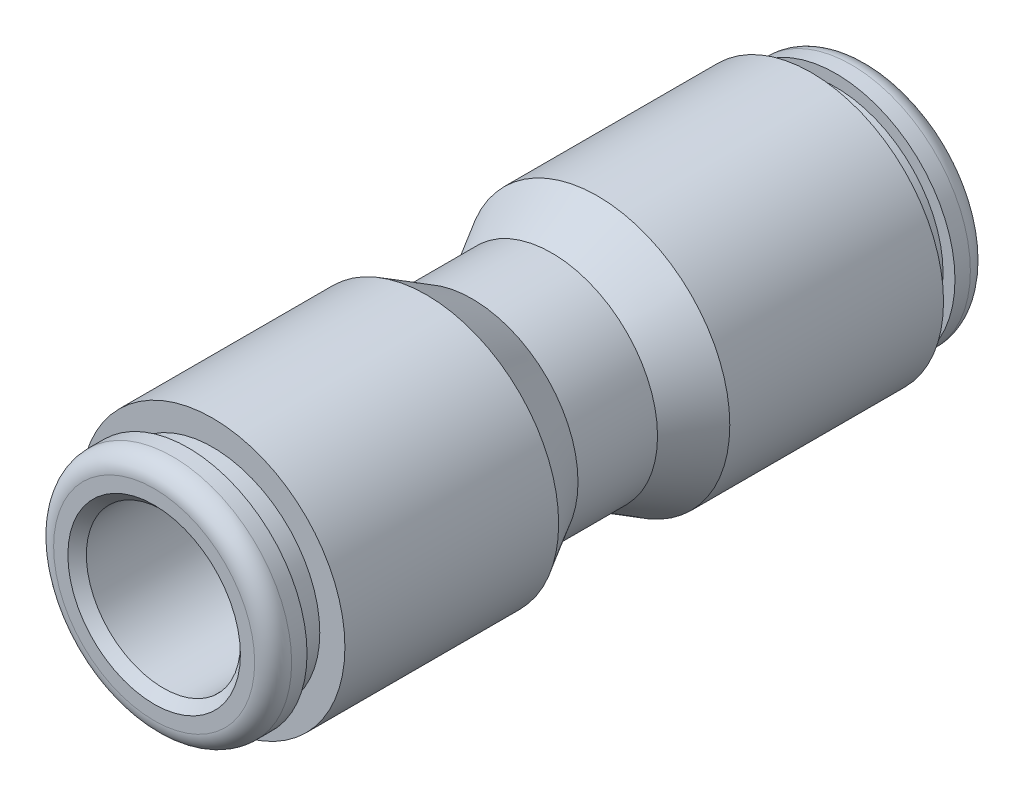
ISO-10303-21;
HEADER;
FILE_DESCRIPTION(('STEP AP214'),'2;1');
FILE_NAME('part.step','',(''),(''),'','','');
FILE_SCHEMA(('AUTOMOTIVE_DESIGN { 1 0 10303 214 1 1 1 1 }'));
ENDSEC;
DATA;
#1=APPLICATION_CONTEXT('core data for automotive mechanical design processes');
#2=APPLICATION_PROTOCOL_DEFINITION('international standard','automotive_design',2000,#1);
#3=PRODUCT_CONTEXT('',#1,'mechanical');
#4=PRODUCT('Part','Part','',(#3));
#5=PRODUCT_RELATED_PRODUCT_CATEGORY('part','',(#4));
#6=PRODUCT_DEFINITION_FORMATION('','',#4);
#7=PRODUCT_DEFINITION_CONTEXT('part definition',#1,'design');
#8=PRODUCT_DEFINITION('design','',#6,#7);
#9=PRODUCT_DEFINITION_SHAPE('','',#8);
#10=(LENGTH_UNIT() NAMED_UNIT(*) SI_UNIT(.MILLI.,.METRE.));
#11=(NAMED_UNIT(*) PLANE_ANGLE_UNIT() SI_UNIT($,.RADIAN.));
#12=(NAMED_UNIT(*) SI_UNIT($,.STERADIAN.) SOLID_ANGLE_UNIT());
#13=UNCERTAINTY_MEASURE_WITH_UNIT(LENGTH_MEASURE(1.E-05),#10,'distance_accuracy_value','');
#14=(GEOMETRIC_REPRESENTATION_CONTEXT(3) GLOBAL_UNCERTAINTY_ASSIGNED_CONTEXT((#13)) GLOBAL_UNIT_ASSIGNED_CONTEXT((#10,
#11,#12)) REPRESENTATION_CONTEXT('',''));
#15=CARTESIAN_POINT('',(0.,0.,0.));
#16=DIRECTION('',(0.,0.,1.));
#17=DIRECTION('',(1.,0.,0.));
#18=AXIS2_PLACEMENT_3D('',#15,#16,#17);
#19=CARTESIAN_POINT('',(0.,0.,-3.52682426913896));
#20=DIRECTION('',(0.,0.,-1.));
#21=DIRECTION('',(-1.,0.,0.));
#22=AXIS2_PLACEMENT_3D('',#19,#20,#21);
#23=CONICAL_SURFACE('',#22,5.45,0.523598775598301);
#24=CARTESIAN_POINT('',(0.,0.,-1.63888888888889));
#25=DIRECTION('',(0.,0.,1.));
#26=DIRECTION('',(1.,0.,0.));
#27=AXIS2_PLACEMENT_3D('',#24,#25,#26);
#28=CIRCLE('',#27,4.36);
#29=CARTESIAN_POINT('',(4.36,0.,-1.63888888888889));
#30=VERTEX_POINT('',#29);
#31=EDGE_CURVE('E74',#30,#30,#28,.T.);
#32=ORIENTED_EDGE('',*,*,#31,.F.);
#33=EDGE_LOOP('',(#32));
#34=FACE_BOUND('',#33,.T.);
#35=CARTESIAN_POINT('',(0.,0.,-3.52682426913896));
#36=DIRECTION('',(0.,0.,1.));
#37=DIRECTION('',(1.,0.,0.));
#38=AXIS2_PLACEMENT_3D('',#35,#36,#37);
#39=CIRCLE('',#38,5.45);
#40=CARTESIAN_POINT('',(5.45,0.,-3.52682426913896));
#41=VERTEX_POINT('',#40);
#42=EDGE_CURVE('E10',#41,#41,#39,.T.);
#43=ORIENTED_EDGE('',*,*,#42,.T.);
#44=EDGE_LOOP('',(#43));
#45=FACE_BOUND('',#44,.T.);
#46=ADVANCED_FACE('F34',(#34,#45),#23,.T.);
#47=CARTESIAN_POINT('',(0.,0.,0.));
#48=DIRECTION('',(0.,0.,1.));
#49=DIRECTION('',(1.,0.,0.));
#50=AXIS2_PLACEMENT_3D('',#47,#48,#49);
#51=CYLINDRICAL_SURFACE('',#50,5.45);
#52=ORIENTED_EDGE('',*,*,#42,.F.);
#53=EDGE_LOOP('',(#52));
#54=FACE_BOUND('',#53,.T.);
#55=CARTESIAN_POINT('',(0.,0.,-12.337));
#56=DIRECTION('',(0.,0.,1.));
#57=DIRECTION('',(1.,0.,0.));
#58=AXIS2_PLACEMENT_3D('',#55,#56,#57);
#59=CIRCLE('',#58,5.45);
#60=CARTESIAN_POINT('',(5.45,0.,-12.337));
#61=VERTEX_POINT('',#60);
#62=EDGE_CURVE('E40',#61,#61,#59,.T.);
#63=ORIENTED_EDGE('',*,*,#62,.T.);
#64=EDGE_LOOP('',(#63));
#65=FACE_BOUND('',#64,.T.);
#66=ADVANCED_FACE('F132',(#54,#65),#51,.T.);
#67=CARTESIAN_POINT('',(0.,5.45,-12.337));
#68=DIRECTION('',(0.,0.,1.));
#69=DIRECTION('',(1.,0.,0.));
#70=AXIS2_PLACEMENT_3D('',#67,#68,#69);
#71=PLANE('',#70);
#72=ORIENTED_EDGE('',*,*,#62,.F.);
#73=EDGE_LOOP('',(#72));
#74=FACE_BOUND('',#73,.T.);
#75=CARTESIAN_POINT('',(0.,0.,-12.337));
#76=DIRECTION('',(0.,0.,1.));
#77=DIRECTION('',(1.,0.,0.));
#78=AXIS2_PLACEMENT_3D('',#75,#76,#77);
#79=CIRCLE('',#78,4.4145);
#80=CARTESIAN_POINT('',(4.4145,0.,-12.337));
#81=VERTEX_POINT('',#80);
#82=EDGE_CURVE('E44',#81,#81,#79,.T.);
#83=ORIENTED_EDGE('',*,*,#82,.T.);
#84=EDGE_LOOP('',(#83));
#85=FACE_BOUND('',#84,.T.);
#86=ADVANCED_FACE('F137',(#74,#85),#71,.F.);
#87=CARTESIAN_POINT('',(0.,0.,0.));
#88=DIRECTION('',(0.,0.,1.));
#89=DIRECTION('',(1.,0.,0.));
#90=AXIS2_PLACEMENT_3D('',#87,#88,#89);
#91=CYLINDRICAL_SURFACE('',#90,4.4145);
#92=ORIENTED_EDGE('',*,*,#82,.F.);
#93=EDGE_LOOP('',(#92));
#94=FACE_BOUND('',#93,.T.);
#95=CARTESIAN_POINT('',(0.,0.,-13.353));
#96=DIRECTION('',(0.,0.,1.));
#97=DIRECTION('',(1.,0.,0.));
#98=AXIS2_PLACEMENT_3D('',#95,#96,#97);
#99=CIRCLE('',#98,4.4145);
#100=CARTESIAN_POINT('',(4.4145,0.,-13.353));
#101=VERTEX_POINT('',#100);
#102=EDGE_CURVE('E48',#101,#101,#99,.T.);
#103=ORIENTED_EDGE('',*,*,#102,.T.);
#104=EDGE_LOOP('',(#103));
#105=FACE_BOUND('',#104,.T.);
#106=ADVANCED_FACE('F143',(#94,#105),#91,.T.);
#107=CARTESIAN_POINT('',(0.,4.905,-13.353));
#108=DIRECTION('',(0.,0.,-1.));
#109=DIRECTION('',(-1.,0.,0.));
#110=AXIS2_PLACEMENT_3D('',#107,#108,#109);
#111=PLANE('',#110);
#112=ORIENTED_EDGE('',*,*,#102,.F.);
#113=EDGE_LOOP('',(#112));
#114=FACE_BOUND('',#113,.T.);
#115=CARTESIAN_POINT('',(0.,0.,-13.353));
#116=DIRECTION('',(0.,0.,1.));
#117=DIRECTION('',(1.,0.,0.));
#118=AXIS2_PLACEMENT_3D('',#115,#116,#117);
#119=CIRCLE('',#118,4.905);
#120=CARTESIAN_POINT('',(4.905,0.,-13.353));
#121=VERTEX_POINT('',#120);
#122=EDGE_CURVE('E53',#121,#121,#119,.T.);
#123=ORIENTED_EDGE('',*,*,#122,.T.);
#124=EDGE_LOOP('',(#123));
#125=FACE_BOUND('',#124,.T.);
#126=ADVANCED_FACE('F149',(#114,#125),#111,.F.);
#127=CARTESIAN_POINT('',(0.,0.,0.));
#128=DIRECTION('',(0.,0.,1.));
#129=DIRECTION('',(1.,0.,0.));
#130=AXIS2_PLACEMENT_3D('',#127,#128,#129);
#131=CYLINDRICAL_SURFACE('',#130,4.905);
#132=ORIENTED_EDGE('',*,*,#122,.F.);
#133=EDGE_LOOP('',(#132));
#134=FACE_BOUND('',#133,.T.);
#135=CARTESIAN_POINT('',(0.,0.,-13.988));
#136=DIRECTION('',(0.,0.,1.));
#137=DIRECTION('',(1.,0.,0.));
#138=AXIS2_PLACEMENT_3D('',#135,#136,#137);
#139=CIRCLE('',#138,4.905);
#140=CARTESIAN_POINT('',(4.905,0.,-13.988));
#141=VERTEX_POINT('',#140);
#142=EDGE_CURVE('E56',#141,#141,#139,.T.);
#143=ORIENTED_EDGE('',*,*,#142,.T.);
#144=EDGE_LOOP('',(#143));
#145=FACE_BOUND('',#144,.T.);
#146=ADVANCED_FACE('F153',(#134,#145),#131,.T.);
#147=CARTESIAN_POINT('',(0.,0.,-13.988));
#148=DIRECTION('',(0.,0.,1.));
#149=DIRECTION('',(1.,0.,0.));
#150=AXIS2_PLACEMENT_3D('',#147,#148,#149);
#151=TOROIDAL_SURFACE('',#150,4.143,0.761999999999999);
#152=ORIENTED_EDGE('',*,*,#142,.F.);
#153=EDGE_LOOP('',(#152));
#154=FACE_BOUND('',#153,.T.);
#155=CARTESIAN_POINT('',(0.,0.,-14.75));
#156=DIRECTION('',(0.,0.,1.));
#157=DIRECTION('',(1.,0.,0.));
#158=AXIS2_PLACEMENT_3D('',#155,#156,#157);
#159=CIRCLE('',#158,4.143);
#160=CARTESIAN_POINT('',(4.143,0.,-14.75));
#161=VERTEX_POINT('',#160);
#162=EDGE_CURVE('E59',#161,#161,#159,.T.);
#163=ORIENTED_EDGE('',*,*,#162,.T.);
#164=EDGE_LOOP('',(#163));
#165=FACE_BOUND('',#164,.T.);
#166=ADVANCED_FACE('F157',(#154,#165),#151,.T.);
#167=CARTESIAN_POINT('',(0.,4.143,-14.75));
#168=DIRECTION('',(0.,0.,1.));
#169=DIRECTION('',(1.,0.,0.));
#170=AXIS2_PLACEMENT_3D('',#167,#168,#169);
#171=PLANE('',#170);
#172=ORIENTED_EDGE('',*,*,#162,.F.);
#173=EDGE_LOOP('',(#172));
#174=FACE_BOUND('',#173,.T.);
#175=CARTESIAN_POINT('',(0.,0.,-14.75));
#176=DIRECTION('',(0.,0.,1.));
#177=DIRECTION('',(1.,0.,0.));
#178=AXIS2_PLACEMENT_3D('',#175,#176,#177);
#179=CIRCLE('',#178,3.556);
#180=CARTESIAN_POINT('',(3.556,0.,-14.75));
#181=VERTEX_POINT('',#180);
#182=EDGE_CURVE('E62',#181,#181,#179,.T.);
#183=ORIENTED_EDGE('',*,*,#182,.T.);
#184=EDGE_LOOP('',(#183));
#185=FACE_BOUND('',#184,.T.);
#186=ADVANCED_FACE('F161',(#174,#185),#171,.F.);
#187=CARTESIAN_POINT('',(0.,0.,-14.369));
#188=DIRECTION('',(0.,0.,-1.));
#189=DIRECTION('',(-1.,0.,0.));
#190=AXIS2_PLACEMENT_3D('',#187,#188,#189);
#191=CONICAL_SURFACE('',#190,3.175,0.785398163397449);
#192=ORIENTED_EDGE('',*,*,#182,.F.);
#193=EDGE_LOOP('',(#192));
#194=FACE_BOUND('',#193,.T.);
#195=CARTESIAN_POINT('',(0.,0.,-14.369));
#196=DIRECTION('',(0.,0.,1.));
#197=DIRECTION('',(1.,0.,0.));
#198=AXIS2_PLACEMENT_3D('',#195,#196,#197);
#199=CIRCLE('',#198,3.175);
#200=CARTESIAN_POINT('',(3.175,0.,-14.369));
#201=VERTEX_POINT('',#200);
#202=EDGE_CURVE('E65',#201,#201,#199,.T.);
#203=ORIENTED_EDGE('',*,*,#202,.T.);
#204=EDGE_LOOP('',(#203));
#205=FACE_BOUND('',#204,.T.);
#206=ADVANCED_FACE('F165',(#194,#205),#191,.F.);
#207=CARTESIAN_POINT('',(0.,0.,0.));
#208=DIRECTION('',(0.,0.,1.));
#209=DIRECTION('',(1.,0.,0.));
#210=AXIS2_PLACEMENT_3D('',#207,#208,#209);
#211=CYLINDRICAL_SURFACE('',#210,3.175);
#212=ORIENTED_EDGE('',*,*,#202,.F.);
#213=EDGE_LOOP('',(#212));
#214=FACE_BOUND('',#213,.T.);
#215=CARTESIAN_POINT('',(0.,0.,-0.250000000000002));
#216=DIRECTION('',(0.,0.,1.));
#217=DIRECTION('',(1.,0.,0.));
#218=AXIS2_PLACEMENT_3D('',#215,#216,#217);
#219=CIRCLE('',#218,3.175);
#220=CARTESIAN_POINT('',(3.175,0.,-0.250000000000002));
#221=VERTEX_POINT('',#220);
#222=EDGE_CURVE('E68',#221,#221,#219,.T.);
#223=ORIENTED_EDGE('',*,*,#222,.T.);
#224=EDGE_LOOP('',(#223));
#225=FACE_BOUND('',#224,.T.);
#226=ADVANCED_FACE('F169',(#214,#225),#211,.F.);
#227=CARTESIAN_POINT('',(0.,3.175,-0.250000000000002));
#228=DIRECTION('',(0.,0.,1.));
#229=DIRECTION('',(1.,0.,0.));
#230=AXIS2_PLACEMENT_3D('',#227,#228,#229);
#231=PLANE('',#230);
#232=ORIENTED_EDGE('',*,*,#222,.F.);
#233=EDGE_LOOP('',(#232));
#234=FACE_BOUND('',#233,.T.);
#235=CARTESIAN_POINT('',(0.,0.,-0.250000000000002));
#236=DIRECTION('',(0.,0.,1.));
#237=DIRECTION('',(1.,0.,0.));
#238=AXIS2_PLACEMENT_3D('',#235,#236,#237);
#239=CIRCLE('',#238,2.413);
#240=CARTESIAN_POINT('',(2.413,0.,-0.250000000000002));
#241=VERTEX_POINT('',#240);
#242=EDGE_CURVE('E71',#241,#241,#239,.T.);
#243=ORIENTED_EDGE('',*,*,#242,.T.);
#244=EDGE_LOOP('',(#243));
#245=FACE_BOUND('',#244,.T.);
#246=ADVANCED_FACE('F128',(#234,#245),#231,.F.);
#247=CARTESIAN_POINT('',(0.,0.,0.));
#248=DIRECTION('',(0.,0.,1.));
#249=DIRECTION('',(1.,0.,0.));
#250=AXIS2_PLACEMENT_3D('',#247,#248,#249);
#251=CYLINDRICAL_SURFACE('',#250,2.413);
#252=ORIENTED_EDGE('',*,*,#242,.F.);
#253=EDGE_LOOP('',(#252));
#254=FACE_BOUND('',#253,.T.);
#255=CARTESIAN_POINT('',(0.,0.,0.250000000000002));
#256=DIRECTION('',(0.,0.,1.));
#257=DIRECTION('',(1.,0.,0.));
#258=AXIS2_PLACEMENT_3D('',#255,#256,#257);
#259=CIRCLE('',#258,2.413);
#260=CARTESIAN_POINT('',(2.413,0.,0.250000000000002));
#261=VERTEX_POINT('',#260);
#262=EDGE_CURVE('E107',#261,#261,#259,.T.);
#263=ORIENTED_EDGE('',*,*,#262,.T.);
#264=EDGE_LOOP('',(#263));
#265=FACE_BOUND('',#264,.T.);
#266=ADVANCED_FACE('F119',(#254,#265),#251,.F.);
#267=CARTESIAN_POINT('',(0.,0.,0.));
#268=DIRECTION('',(0.,0.,1.));
#269=DIRECTION('',(1.,0.,0.));
#270=AXIS2_PLACEMENT_3D('',#267,#268,#269);
#271=CYLINDRICAL_SURFACE('',#270,4.36);
#272=ORIENTED_EDGE('',*,*,#31,.T.);
#273=EDGE_LOOP('',(#272));
#274=FACE_BOUND('',#273,.T.);
#275=CARTESIAN_POINT('',(0.,0.,1.63888888888889));
#276=DIRECTION('',(0.,0.,1.));
#277=DIRECTION('',(1.,0.,0.));
#278=AXIS2_PLACEMENT_3D('',#275,#276,#277);
#279=CIRCLE('',#278,4.36);
#280=CARTESIAN_POINT('',(4.36,0.,1.63888888888889));
#281=VERTEX_POINT('',#280);
#282=EDGE_CURVE('E110',#281,#281,#279,.T.);
#283=ORIENTED_EDGE('',*,*,#282,.F.);
#284=EDGE_LOOP('',(#283));
#285=FACE_BOUND('',#284,.T.);
#286=ADVANCED_FACE('F117',(#274,#285),#271,.T.);
#287=CARTESIAN_POINT('',(0.,0.,3.52682426913896));
#288=DIRECTION('',(0.,0.,1.));
#289=DIRECTION('',(-1.,0.,0.));
#290=AXIS2_PLACEMENT_3D('',#287,#288,#289);
#291=CONICAL_SURFACE('',#290,5.45,0.523598775598301);
#292=ORIENTED_EDGE('',*,*,#282,.T.);
#293=EDGE_LOOP('',(#292));
#294=FACE_BOUND('',#293,.T.);
#295=CARTESIAN_POINT('',(0.,0.,3.52682426913896));
#296=DIRECTION('',(0.,0.,1.));
#297=DIRECTION('',(1.,0.,0.));
#298=AXIS2_PLACEMENT_3D('',#295,#296,#297);
#299=CIRCLE('',#298,5.45);
#300=CARTESIAN_POINT('',(5.45,0.,3.52682426913896));
#301=VERTEX_POINT('',#300);
#302=EDGE_CURVE('E77',#301,#301,#299,.T.);
#303=ORIENTED_EDGE('',*,*,#302,.F.);
#304=EDGE_LOOP('',(#303));
#305=FACE_BOUND('',#304,.T.);
#306=ADVANCED_FACE('F114',(#294,#305),#291,.T.);
#307=CARTESIAN_POINT('',(0.,0.,0.));
#308=DIRECTION('',(0.,0.,-1.));
#309=DIRECTION('',(1.,0.,0.));
#310=AXIS2_PLACEMENT_3D('',#307,#308,#309);
#311=CYLINDRICAL_SURFACE('',#310,5.45);
#312=ORIENTED_EDGE('',*,*,#302,.T.);
#313=EDGE_LOOP('',(#312));
#314=FACE_BOUND('',#313,.T.);
#315=CARTESIAN_POINT('',(0.,0.,12.337));
#316=DIRECTION('',(0.,0.,1.));
#317=DIRECTION('',(1.,0.,0.));
#318=AXIS2_PLACEMENT_3D('',#315,#316,#317);
#319=CIRCLE('',#318,5.45);
#320=CARTESIAN_POINT('',(5.45,0.,12.337));
#321=VERTEX_POINT('',#320);
#322=EDGE_CURVE('E80',#321,#321,#319,.T.);
#323=ORIENTED_EDGE('',*,*,#322,.F.);
#324=EDGE_LOOP('',(#323));
#325=FACE_BOUND('',#324,.T.);
#326=ADVANCED_FACE('F126',(#314,#325),#311,.T.);
#327=CARTESIAN_POINT('',(0.,5.45,12.337));
#328=DIRECTION('',(0.,0.,-1.));
#329=DIRECTION('',(1.,0.,0.));
#330=AXIS2_PLACEMENT_3D('',#327,#328,#329);
#331=PLANE('',#330);
#332=ORIENTED_EDGE('',*,*,#322,.T.);
#333=EDGE_LOOP('',(#332));
#334=FACE_BOUND('',#333,.T.);
#335=CARTESIAN_POINT('',(0.,0.,12.337));
#336=DIRECTION('',(0.,0.,1.));
#337=DIRECTION('',(1.,0.,0.));
#338=AXIS2_PLACEMENT_3D('',#335,#336,#337);
#339=CIRCLE('',#338,4.4145);
#340=CARTESIAN_POINT('',(4.4145,0.,12.337));
#341=VERTEX_POINT('',#340);
#342=EDGE_CURVE('E83',#341,#341,#339,.T.);
#343=ORIENTED_EDGE('',*,*,#342,.F.);
#344=EDGE_LOOP('',(#343));
#345=FACE_BOUND('',#344,.T.);
#346=ADVANCED_FACE('F218',(#334,#345),#331,.F.);
#347=CARTESIAN_POINT('',(0.,0.,0.));
#348=DIRECTION('',(0.,0.,-1.));
#349=DIRECTION('',(1.,0.,0.));
#350=AXIS2_PLACEMENT_3D('',#347,#348,#349);
#351=CYLINDRICAL_SURFACE('',#350,4.4145);
#352=ORIENTED_EDGE('',*,*,#342,.T.);
#353=EDGE_LOOP('',(#352));
#354=FACE_BOUND('',#353,.T.);
#355=CARTESIAN_POINT('',(0.,0.,13.353));
#356=DIRECTION('',(0.,0.,1.));
#357=DIRECTION('',(1.,0.,0.));
#358=AXIS2_PLACEMENT_3D('',#355,#356,#357);
#359=CIRCLE('',#358,4.4145);
#360=CARTESIAN_POINT('',(4.4145,0.,13.353));
#361=VERTEX_POINT('',#360);
#362=EDGE_CURVE('E86',#361,#361,#359,.T.);
#363=ORIENTED_EDGE('',*,*,#362,.F.);
#364=EDGE_LOOP('',(#363));
#365=FACE_BOUND('',#364,.T.);
#366=ADVANCED_FACE('F214',(#354,#365),#351,.T.);
#367=CARTESIAN_POINT('',(0.,4.905,13.353));
#368=DIRECTION('',(0.,0.,1.));
#369=DIRECTION('',(-1.,0.,0.));
#370=AXIS2_PLACEMENT_3D('',#367,#368,#369);
#371=PLANE('',#370);
#372=ORIENTED_EDGE('',*,*,#362,.T.);
#373=EDGE_LOOP('',(#372));
#374=FACE_BOUND('',#373,.T.);
#375=CARTESIAN_POINT('',(0.,0.,13.353));
#376=DIRECTION('',(0.,0.,1.));
#377=DIRECTION('',(1.,0.,0.));
#378=AXIS2_PLACEMENT_3D('',#375,#376,#377);
#379=CIRCLE('',#378,4.905);
#380=CARTESIAN_POINT('',(4.905,0.,13.353));
#381=VERTEX_POINT('',#380);
#382=EDGE_CURVE('E89',#381,#381,#379,.T.);
#383=ORIENTED_EDGE('',*,*,#382,.F.);
#384=EDGE_LOOP('',(#383));
#385=FACE_BOUND('',#384,.T.);
#386=ADVANCED_FACE('F210',(#374,#385),#371,.F.);
#387=CARTESIAN_POINT('',(0.,0.,0.));
#388=DIRECTION('',(0.,0.,-1.));
#389=DIRECTION('',(1.,0.,0.));
#390=AXIS2_PLACEMENT_3D('',#387,#388,#389);
#391=CYLINDRICAL_SURFACE('',#390,4.905);
#392=ORIENTED_EDGE('',*,*,#382,.T.);
#393=EDGE_LOOP('',(#392));
#394=FACE_BOUND('',#393,.T.);
#395=CARTESIAN_POINT('',(0.,0.,13.988));
#396=DIRECTION('',(0.,0.,1.));
#397=DIRECTION('',(1.,0.,0.));
#398=AXIS2_PLACEMENT_3D('',#395,#396,#397);
#399=CIRCLE('',#398,4.905);
#400=CARTESIAN_POINT('',(4.905,0.,13.988));
#401=VERTEX_POINT('',#400);
#402=EDGE_CURVE('E92',#401,#401,#399,.T.);
#403=ORIENTED_EDGE('',*,*,#402,.F.);
#404=EDGE_LOOP('',(#403));
#405=FACE_BOUND('',#404,.T.);
#406=ADVANCED_FACE('F206',(#394,#405),#391,.T.);
#407=CARTESIAN_POINT('',(0.,0.,13.988));
#408=DIRECTION('',(0.,0.,-1.));
#409=DIRECTION('',(1.,0.,0.));
#410=AXIS2_PLACEMENT_3D('',#407,#408,#409);
#411=TOROIDAL_SURFACE('',#410,4.143,0.761999999999999);
#412=ORIENTED_EDGE('',*,*,#402,.T.);
#413=EDGE_LOOP('',(#412));
#414=FACE_BOUND('',#413,.T.);
#415=CARTESIAN_POINT('',(0.,0.,14.75));
#416=DIRECTION('',(0.,0.,1.));
#417=DIRECTION('',(1.,0.,0.));
#418=AXIS2_PLACEMENT_3D('',#415,#416,#417);
#419=CIRCLE('',#418,4.143);
#420=CARTESIAN_POINT('',(4.143,0.,14.75));
#421=VERTEX_POINT('',#420);
#422=EDGE_CURVE('E95',#421,#421,#419,.T.);
#423=ORIENTED_EDGE('',*,*,#422,.F.);
#424=EDGE_LOOP('',(#423));
#425=FACE_BOUND('',#424,.T.);
#426=ADVANCED_FACE('F202',(#414,#425),#411,.T.);
#427=CARTESIAN_POINT('',(0.,4.143,14.75));
#428=DIRECTION('',(0.,0.,-1.));
#429=DIRECTION('',(1.,0.,0.));
#430=AXIS2_PLACEMENT_3D('',#427,#428,#429);
#431=PLANE('',#430);
#432=ORIENTED_EDGE('',*,*,#422,.T.);
#433=EDGE_LOOP('',(#432));
#434=FACE_BOUND('',#433,.T.);
#435=CARTESIAN_POINT('',(0.,0.,14.75));
#436=DIRECTION('',(0.,0.,1.));
#437=DIRECTION('',(1.,0.,0.));
#438=AXIS2_PLACEMENT_3D('',#435,#436,#437);
#439=CIRCLE('',#438,3.556);
#440=CARTESIAN_POINT('',(3.556,0.,14.75));
#441=VERTEX_POINT('',#440);
#442=EDGE_CURVE('E98',#441,#441,#439,.T.);
#443=ORIENTED_EDGE('',*,*,#442,.F.);
#444=EDGE_LOOP('',(#443));
#445=FACE_BOUND('',#444,.T.);
#446=ADVANCED_FACE('F198',(#434,#445),#431,.F.);
#447=CARTESIAN_POINT('',(0.,0.,14.369));
#448=DIRECTION('',(0.,0.,1.));
#449=DIRECTION('',(-1.,0.,0.));
#450=AXIS2_PLACEMENT_3D('',#447,#448,#449);
#451=CONICAL_SURFACE('',#450,3.175,0.785398163397449);
#452=ORIENTED_EDGE('',*,*,#442,.T.);
#453=EDGE_LOOP('',(#452));
#454=FACE_BOUND('',#453,.T.);
#455=CARTESIAN_POINT('',(0.,0.,14.369));
#456=DIRECTION('',(0.,0.,1.));
#457=DIRECTION('',(1.,0.,0.));
#458=AXIS2_PLACEMENT_3D('',#455,#456,#457);
#459=CIRCLE('',#458,3.175);
#460=CARTESIAN_POINT('',(3.175,0.,14.369));
#461=VERTEX_POINT('',#460);
#462=EDGE_CURVE('E101',#461,#461,#459,.T.);
#463=ORIENTED_EDGE('',*,*,#462,.F.);
#464=EDGE_LOOP('',(#463));
#465=FACE_BOUND('',#464,.T.);
#466=ADVANCED_FACE('F192',(#454,#465),#451,.F.);
#467=CARTESIAN_POINT('',(0.,0.,0.));
#468=DIRECTION('',(0.,0.,-1.));
#469=DIRECTION('',(1.,0.,0.));
#470=AXIS2_PLACEMENT_3D('',#467,#468,#469);
#471=CYLINDRICAL_SURFACE('',#470,3.175);
#472=ORIENTED_EDGE('',*,*,#462,.T.);
#473=EDGE_LOOP('',(#472));
#474=FACE_BOUND('',#473,.T.);
#475=CARTESIAN_POINT('',(0.,0.,0.250000000000002));
#476=DIRECTION('',(0.,0.,1.));
#477=DIRECTION('',(1.,0.,0.));
#478=AXIS2_PLACEMENT_3D('',#475,#476,#477);
#479=CIRCLE('',#478,3.175);
#480=CARTESIAN_POINT('',(3.175,0.,0.250000000000002));
#481=VERTEX_POINT('',#480);
#482=EDGE_CURVE('E104',#481,#481,#479,.T.);
#483=ORIENTED_EDGE('',*,*,#482,.F.);
#484=EDGE_LOOP('',(#483));
#485=FACE_BOUND('',#484,.T.);
#486=ADVANCED_FACE('F186',(#474,#485),#471,.F.);
#487=CARTESIAN_POINT('',(0.,3.175,0.250000000000002));
#488=DIRECTION('',(0.,0.,-1.));
#489=DIRECTION('',(1.,0.,0.));
#490=AXIS2_PLACEMENT_3D('',#487,#488,#489);
#491=PLANE('',#490);
#492=ORIENTED_EDGE('',*,*,#482,.T.);
#493=EDGE_LOOP('',(#492));
#494=FACE_BOUND('',#493,.T.);
#495=ORIENTED_EDGE('',*,*,#262,.F.);
#496=EDGE_LOOP('',(#495));
#497=FACE_BOUND('',#496,.T.);
#498=ADVANCED_FACE('F184',(#494,#497),#491,.F.);
#499=CLOSED_SHELL('',(#46,#66,#86,#106,#126,#146,#166,#186,#206,#226,#246,#266,#286,#306,#326,
#346,#366,#386,#406,#426,#446,#466,#486,#498));
#500=MANIFOLD_SOLID_BREP('B2',#499);
#501=ADVANCED_BREP_SHAPE_REPRESENTATION('',(#18,#500),#14);
#502=SHAPE_DEFINITION_REPRESENTATION(#9,#501);
ENDSEC;
END-ISO-10303-21;
